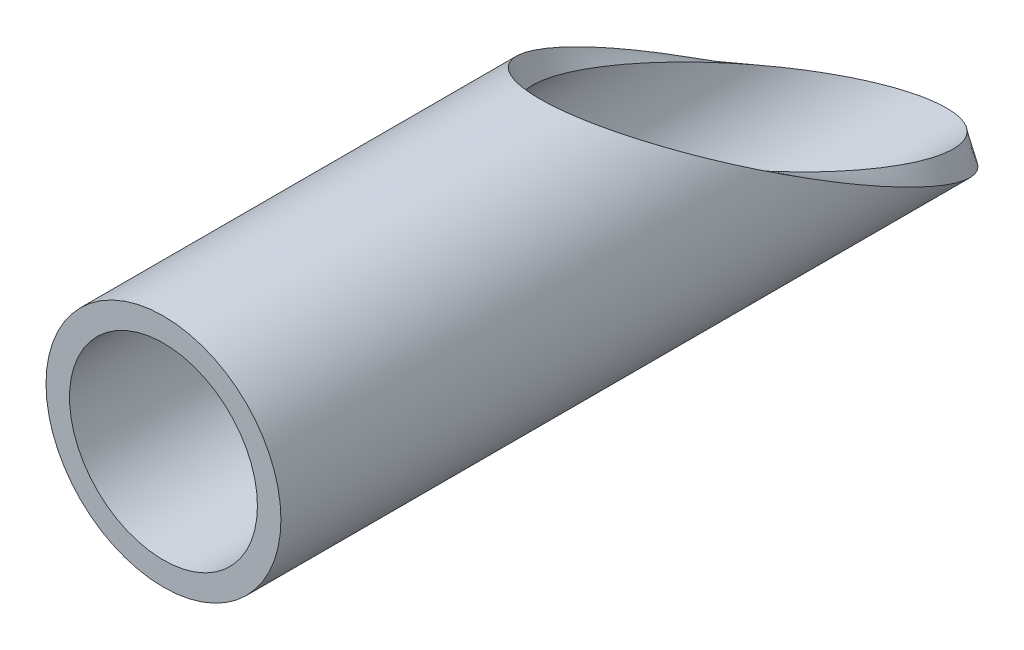
ISO-10303-21;
HEADER;
FILE_DESCRIPTION(('STEP AP214'),'2;1');
FILE_NAME('part.step','',(''),(''),'','','');
FILE_SCHEMA(('AUTOMOTIVE_DESIGN { 1 0 10303 214 1 1 1 1 }'));
ENDSEC;
DATA;
#1=APPLICATION_CONTEXT('core data for automotive mechanical design processes');
#2=APPLICATION_PROTOCOL_DEFINITION('international standard','automotive_design',2000,#1);
#3=PRODUCT_CONTEXT('',#1,'mechanical');
#4=PRODUCT('Part','Part','',(#3));
#5=PRODUCT_RELATED_PRODUCT_CATEGORY('part','',(#4));
#6=PRODUCT_DEFINITION_FORMATION('','',#4);
#7=PRODUCT_DEFINITION_CONTEXT('part definition',#1,'design');
#8=PRODUCT_DEFINITION('design','',#6,#7);
#9=PRODUCT_DEFINITION_SHAPE('','',#8);
#10=(LENGTH_UNIT() NAMED_UNIT(*) SI_UNIT(.MILLI.,.METRE.));
#11=(NAMED_UNIT(*) PLANE_ANGLE_UNIT() SI_UNIT($,.RADIAN.));
#12=(NAMED_UNIT(*) SI_UNIT($,.STERADIAN.) SOLID_ANGLE_UNIT());
#13=UNCERTAINTY_MEASURE_WITH_UNIT(LENGTH_MEASURE(1.E-05),#10,'distance_accuracy_value','');
#14=(GEOMETRIC_REPRESENTATION_CONTEXT(3) GLOBAL_UNCERTAINTY_ASSIGNED_CONTEXT((#13)) GLOBAL_UNIT_ASSIGNED_CONTEXT((#10,
#11,#12)) REPRESENTATION_CONTEXT('',''));
#15=CARTESIAN_POINT('',(0.,0.,0.));
#16=DIRECTION('',(0.,0.,1.));
#17=DIRECTION('',(1.,0.,0.));
#18=AXIS2_PLACEMENT_3D('',#15,#16,#17);
#19=CARTESIAN_POINT('',(0.,0.,100.));
#20=DIRECTION('',(0.,0.,-1.));
#21=DIRECTION('',(-1.,0.,0.));
#22=AXIS2_PLACEMENT_3D('',#19,#20,#21);
#23=PLANE('',#22);
#24=CARTESIAN_POINT('',(0.,0.,100.));
#25=DIRECTION('',(0.,0.,1.));
#26=DIRECTION('',(1.,0.,0.));
#27=AXIS2_PLACEMENT_3D('',#24,#25,#26);
#28=CIRCLE('',#27,15.);
#29=CARTESIAN_POINT('',(15.,0.,100.));
#30=VERTEX_POINT('',#29);
#31=EDGE_CURVE('E47',#30,#30,#28,.T.);
#32=ORIENTED_EDGE('',*,*,#31,.T.);
#33=EDGE_LOOP('',(#32));
#34=FACE_BOUND('',#33,.T.);
#35=CARTESIAN_POINT('',(0.,0.,100.));
#36=DIRECTION('',(0.,0.,1.));
#37=DIRECTION('',(1.,0.,0.));
#38=AXIS2_PLACEMENT_3D('',#35,#36,#37);
#39=CIRCLE('',#38,12.);
#40=CARTESIAN_POINT('',(12.,0.,100.));
#41=VERTEX_POINT('',#40);
#42=EDGE_CURVE('E53',#41,#41,#39,.T.);
#43=ORIENTED_EDGE('',*,*,#42,.F.);
#44=EDGE_LOOP('',(#43));
#45=FACE_BOUND('',#44,.T.);
#46=ADVANCED_FACE('F37',(#34,#45),#23,.F.);
#47=CARTESIAN_POINT('',(0.,15.,51.9615242270658));
#48=CARTESIAN_POINT('',(0.,14.,51.9615242270658));
#49=CARTESIAN_POINT('',(0.,13.,51.9615242270658));
#50=CARTESIAN_POINT('',(0.,12.,51.9615242270658));
#51=CARTESIAN_POINT('',(-30.,15.,51.9615242270658));
#52=CARTESIAN_POINT('',(-28.,14.,51.9615242270658));
#53=CARTESIAN_POINT('',(-26.,13.,51.9615242270658));
#54=CARTESIAN_POINT('',(-24.,12.,51.9615242270658));
#55=CARTESIAN_POINT('',(-30.,-15.,0.));
#56=CARTESIAN_POINT('',(-28.,-14.,0.));
#57=CARTESIAN_POINT('',(-26.,-13.,0.));
#58=CARTESIAN_POINT('',(-24.,-12.,0.));
#59=CARTESIAN_POINT('',(0.,-15.,0.));
#60=CARTESIAN_POINT('',(0.,-14.,0.));
#61=CARTESIAN_POINT('',(0.,-13.,0.));
#62=CARTESIAN_POINT('',(0.,-12.,0.));
#63=CARTESIAN_POINT('',(30.,-15.,0.));
#64=CARTESIAN_POINT('',(28.,-14.,0.));
#65=CARTESIAN_POINT('',(26.,-13.,0.));
#66=CARTESIAN_POINT('',(24.,-12.,0.));
#67=CARTESIAN_POINT('',(30.,15.,51.9615242270658));
#68=CARTESIAN_POINT('',(28.,14.,51.9615242270658));
#69=CARTESIAN_POINT('',(26.,13.,51.9615242270658));
#70=CARTESIAN_POINT('',(24.,12.,51.9615242270658));
#71=CARTESIAN_POINT('',(0.,15.,51.9615242270658));
#72=CARTESIAN_POINT('',(0.,14.,51.9615242270658));
#73=CARTESIAN_POINT('',(0.,13.,51.9615242270658));
#74=CARTESIAN_POINT('',(0.,12.,51.9615242270658));
#75=(BOUNDED_SURFACE() B_SPLINE_SURFACE(3,3,((#47,#48,#49,#50),(#51,#52,#53,#54),(#55,#56,#57,
#58),(#59,#60,#61,#62),(#63,#64,#65,#66),(#67,#68,#69,#70),(#71,#72,#73,#74)),.UNSPECIFIED.,.T.,
.F.,.F.) B_SPLINE_SURFACE_WITH_KNOTS((4,3,4),(4,4),(0.,0.5,1.),(0.,1.),
.UNSPECIFIED.) GEOMETRIC_REPRESENTATION_ITEM() RATIONAL_B_SPLINE_SURFACE(((1.,1.,1.,1.),
(0.333333333333333,0.333333333333333,0.333333333333333,0.333333333333333),(0.333333333333333,
0.333333333333333,0.333333333333333,0.333333333333333),(1.,1.,1.,1.),(0.333333333333333,
0.333333333333333,0.333333333333333,0.333333333333333),(0.333333333333333,0.333333333333333,
0.333333333333333,0.333333333333333),(1.,1.,1.,1.))) REPRESENTATION_ITEM('') SURFACE());
#76=CARTESIAN_POINT('',(0.,0.,25.9807621135329));
#77=DIRECTION('',(0.,0.866025403784436,-0.500000000000004));
#78=DIRECTION('',(0.,0.500000000000004,0.866025403784436));
#79=AXIS2_PLACEMENT_3D('',#76,#77,#78);
#80=ELLIPSE('',#79,29.9999999999998,15.);
#81=CARTESIAN_POINT('',(0.,15.,51.9615242270658));
#82=VERTEX_POINT('',#81);
#83=EDGE_CURVE('E10',#82,#82,#80,.F.);
#84=CARTESIAN_POINT('',(0.,0.,25.9807621135329));
#85=DIRECTION('',(0.,0.907841299003202,-0.419313934688771));
#86=DIRECTION('',(0.,0.419313934688771,0.907841299003202));
#87=AXIS2_PLACEMENT_3D('',#84,#85,#86);
#88=ELLIPSE('',#87,28.6181760425081,12.);
#89=CARTESIAN_POINT('',(0.,12.,51.9615242270658));
#90=VERTEX_POINT('',#89);
#91=EDGE_CURVE('E43',#90,#90,#88,.F.);
#92=ORIENTED_EDGE('',*,*,#83,.F.);
#93=EDGE_LOOP('',(#92));
#94=FACE_BOUND('',#93,.T.);
#95=ORIENTED_EDGE('',*,*,#91,.T.);
#96=EDGE_LOOP('',(#95));
#97=FACE_BOUND('',#96,.T.);
#98=ADVANCED_FACE('F39',(#94,#97),#75,.F.);
#99=CARTESIAN_POINT('',(0.,0.,0.));
#100=DIRECTION('',(0.,0.,1.));
#101=DIRECTION('',(1.,0.,0.));
#102=AXIS2_PLACEMENT_3D('',#99,#100,#101);
#103=CYLINDRICAL_SURFACE('',#102,15.);
#104=ORIENTED_EDGE('',*,*,#31,.F.);
#105=EDGE_LOOP('',(#104));
#106=FACE_BOUND('',#105,.T.);
#107=ORIENTED_EDGE('',*,*,#83,.T.);
#108=EDGE_LOOP('',(#107));
#109=FACE_BOUND('',#108,.T.);
#110=ADVANCED_FACE('F63',(#106,#109),#103,.T.);
#111=CARTESIAN_POINT('',(0.,0.,0.));
#112=DIRECTION('',(0.,0.,1.));
#113=DIRECTION('',(1.,0.,0.));
#114=AXIS2_PLACEMENT_3D('',#111,#112,#113);
#115=CYLINDRICAL_SURFACE('',#114,12.);
#116=ORIENTED_EDGE('',*,*,#42,.T.);
#117=EDGE_LOOP('',(#116));
#118=FACE_BOUND('',#117,.T.);
#119=ORIENTED_EDGE('',*,*,#91,.F.);
#120=EDGE_LOOP('',(#119));
#121=FACE_BOUND('',#120,.T.);
#122=ADVANCED_FACE('F61',(#118,#121),#115,.F.);
#123=CLOSED_SHELL('',(#46,#98,#110,#122));
#124=MANIFOLD_SOLID_BREP('B2',#123);
#125=ADVANCED_BREP_SHAPE_REPRESENTATION('',(#18,#124),#14);
#126=SHAPE_DEFINITION_REPRESENTATION(#9,#125);
ENDSEC;
END-ISO-10303-21;
